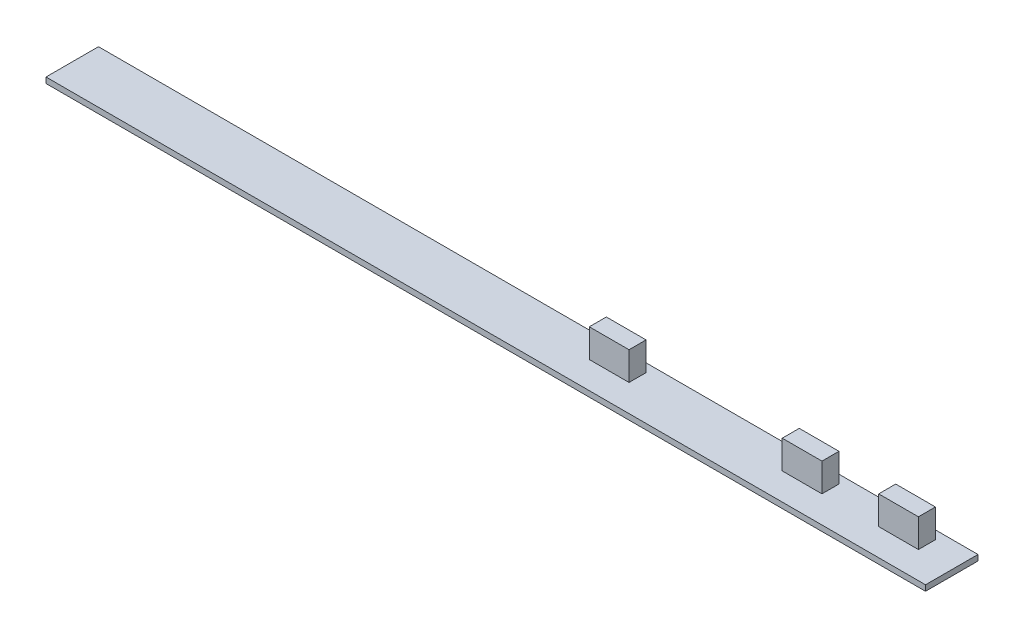
ISO-10303-21;
HEADER;
FILE_DESCRIPTION(('STEP AP214'),'2;1');
FILE_NAME('part.step','',(''),(''),'','','');
FILE_SCHEMA(('AUTOMOTIVE_DESIGN { 1 0 10303 214 1 1 1 1 }'));
ENDSEC;
DATA;
#1=APPLICATION_CONTEXT('core data for automotive mechanical design processes');
#2=APPLICATION_PROTOCOL_DEFINITION('international standard','automotive_design',2000,#1);
#3=PRODUCT_CONTEXT('',#1,'mechanical');
#4=PRODUCT('Part','Part','',(#3));
#5=PRODUCT_RELATED_PRODUCT_CATEGORY('part','',(#4));
#6=PRODUCT_DEFINITION_FORMATION('','',#4);
#7=PRODUCT_DEFINITION_CONTEXT('part definition',#1,'design');
#8=PRODUCT_DEFINITION('design','',#6,#7);
#9=PRODUCT_DEFINITION_SHAPE('','',#8);
#10=(LENGTH_UNIT() NAMED_UNIT(*) SI_UNIT(.MILLI.,.METRE.));
#11=(NAMED_UNIT(*) PLANE_ANGLE_UNIT() SI_UNIT($,.RADIAN.));
#12=(NAMED_UNIT(*) SI_UNIT($,.STERADIAN.) SOLID_ANGLE_UNIT());
#13=UNCERTAINTY_MEASURE_WITH_UNIT(LENGTH_MEASURE(1.E-05),#10,'distance_accuracy_value','');
#14=(GEOMETRIC_REPRESENTATION_CONTEXT(3) GLOBAL_UNCERTAINTY_ASSIGNED_CONTEXT((#13)) GLOBAL_UNIT_ASSIGNED_CONTEXT((#10,
#11,#12)) REPRESENTATION_CONTEXT('',''));
#15=CARTESIAN_POINT('',(0.,0.,0.));
#16=DIRECTION('',(0.,0.,1.));
#17=DIRECTION('',(1.,0.,0.));
#18=AXIS2_PLACEMENT_3D('',#15,#16,#17);
#19=CARTESIAN_POINT('',(635.59224857648,93.3157017452683,-15.231030609953));
#20=DIRECTION('',(0.,1.,0.));
#21=DIRECTION('',(0.,0.,1.));
#22=AXIS2_PLACEMENT_3D('',#19,#20,#21);
#23=PLANE('',#22);
#24=DIRECTION('',(0.,0.,-1.));
#25=VECTOR('',#24,1.);
#26=CARTESIAN_POINT('',(696.894917120642,93.3157017452683,55.9989117513526));
#27=LINE('',#26,#25);
#28=CARTESIAN_POINT('',(696.894917120642,93.3157017452683,52.9989117513526));
#29=VERTEX_POINT('',#28);
#30=CARTESIAN_POINT('',(696.894917120642,93.3157017452683,55.9989117513526));
#31=VERTEX_POINT('',#30);
#32=EDGE_CURVE('E143',#29,#31,#27,.F.);
#33=ORIENTED_EDGE('',*,*,#32,.F.);
#34=DIRECTION('',(-1.,0.,0.));
#35=VECTOR('',#34,1.);
#36=CARTESIAN_POINT('',(696.894917120642,93.3157017452683,52.9989117513526));
#37=LINE('',#36,#35);
#38=CARTESIAN_POINT('',(689.894917120642,93.3157017452683,52.9989117513526));
#39=VERTEX_POINT('',#38);
#40=EDGE_CURVE('E127',#39,#29,#37,.F.);
#41=ORIENTED_EDGE('',*,*,#40,.F.);
#42=DIRECTION('',(0.,0.,1.));
#43=VECTOR('',#42,1.);
#44=CARTESIAN_POINT('',(689.894917120642,93.3157017452683,52.9989117513526));
#45=LINE('',#44,#43);
#46=CARTESIAN_POINT('',(689.894917120642,93.3157017452683,55.9989117513526));
#47=VERTEX_POINT('',#46);
#48=EDGE_CURVE('E20',#47,#39,#45,.F.);
#49=ORIENTED_EDGE('',*,*,#48,.F.);
#50=DIRECTION('',(1.,0.,0.));
#51=VECTOR('',#50,1.);
#52=CARTESIAN_POINT('',(689.894917120642,93.3157017452683,55.9989117513526));
#53=LINE('',#52,#51);
#54=EDGE_CURVE('E150',#31,#47,#53,.F.);
#55=ORIENTED_EDGE('',*,*,#54,.F.);
#56=EDGE_LOOP('',(#33,#41,#49,#55));
#57=FACE_BOUND('',#56,.T.);
#58=ADVANCED_FACE('F17',(#57),#23,.T.);
#59=CARTESIAN_POINT('',(618.59224857648,93.3157017452683,-15.231030609953));
#60=DIRECTION('',(0.,1.,0.));
#61=DIRECTION('',(0.,0.,1.));
#62=AXIS2_PLACEMENT_3D('',#59,#60,#61);
#63=PLANE('',#62);
#64=DIRECTION('',(0.,0.,-1.));
#65=VECTOR('',#64,1.);
#66=CARTESIAN_POINT('',(679.894917120642,93.3157017452683,55.9989117513526));
#67=LINE('',#66,#65);
#68=CARTESIAN_POINT('',(679.894917120642,93.3157017452683,52.9989117513526));
#69=VERTEX_POINT('',#68);
#70=CARTESIAN_POINT('',(679.894917120642,93.3157017452683,55.9989117513526));
#71=VERTEX_POINT('',#70);
#72=EDGE_CURVE('E163',#69,#71,#67,.F.);
#73=ORIENTED_EDGE('',*,*,#72,.F.);
#74=DIRECTION('',(-1.,0.,0.));
#75=VECTOR('',#74,1.);
#76=CARTESIAN_POINT('',(679.894917120642,93.3157017452683,52.9989117513526));
#77=LINE('',#76,#75);
#78=CARTESIAN_POINT('',(672.894917120642,93.3157017452683,52.9989117513526));
#79=VERTEX_POINT('',#78);
#80=EDGE_CURVE('E158',#79,#69,#77,.F.);
#81=ORIENTED_EDGE('',*,*,#80,.F.);
#82=DIRECTION('',(0.,0.,1.));
#83=VECTOR('',#82,1.);
#84=CARTESIAN_POINT('',(672.894917120642,93.3157017452683,52.9989117513526));
#85=LINE('',#84,#83);
#86=CARTESIAN_POINT('',(672.894917120642,93.3157017452683,55.9989117513526));
#87=VERTEX_POINT('',#86);
#88=EDGE_CURVE('E156',#87,#79,#85,.F.);
#89=ORIENTED_EDGE('',*,*,#88,.F.);
#90=DIRECTION('',(1.,0.,0.));
#91=VECTOR('',#90,1.);
#92=CARTESIAN_POINT('',(672.894917120642,93.3157017452683,55.9989117513526));
#93=LINE('',#92,#91);
#94=EDGE_CURVE('E168',#71,#87,#93,.F.);
#95=ORIENTED_EDGE('',*,*,#94,.F.);
#96=EDGE_LOOP('',(#73,#81,#89,#95));
#97=FACE_BOUND('',#96,.T.);
#98=ADVANCED_FACE('F325',(#97),#63,.T.);
#99=CARTESIAN_POINT('',(584.59224857648,93.3157017452683,-15.231030609953));
#100=DIRECTION('',(0.,1.,0.));
#101=DIRECTION('',(0.,0.,1.));
#102=AXIS2_PLACEMENT_3D('',#99,#100,#101);
#103=PLANE('',#102);
#104=DIRECTION('',(0.,0.,-1.));
#105=VECTOR('',#104,1.);
#106=CARTESIAN_POINT('',(645.894917120642,93.3157017452683,55.9989117513526));
#107=LINE('',#106,#105);
#108=CARTESIAN_POINT('',(645.894917120642,93.3157017452683,52.9989117513526));
#109=VERTEX_POINT('',#108);
#110=CARTESIAN_POINT('',(645.894917120642,93.3157017452683,55.9989117513526));
#111=VERTEX_POINT('',#110);
#112=EDGE_CURVE('E182',#109,#111,#107,.F.);
#113=ORIENTED_EDGE('',*,*,#112,.F.);
#114=DIRECTION('',(-1.,0.,0.));
#115=VECTOR('',#114,1.);
#116=CARTESIAN_POINT('',(645.894917120642,93.3157017452683,52.9989117513526));
#117=LINE('',#116,#115);
#118=CARTESIAN_POINT('',(638.894917120642,93.3157017452683,52.9989117513526));
#119=VERTEX_POINT('',#118);
#120=EDGE_CURVE('E177',#119,#109,#117,.F.);
#121=ORIENTED_EDGE('',*,*,#120,.F.);
#122=DIRECTION('',(0.,0.,1.));
#123=VECTOR('',#122,1.);
#124=CARTESIAN_POINT('',(638.894917120642,93.3157017452683,52.9989117513526));
#125=LINE('',#124,#123);
#126=CARTESIAN_POINT('',(638.894917120642,93.3157017452683,55.9989117513526));
#127=VERTEX_POINT('',#126);
#128=EDGE_CURVE('E175',#127,#119,#125,.F.);
#129=ORIENTED_EDGE('',*,*,#128,.F.);
#130=DIRECTION('',(1.,0.,0.));
#131=VECTOR('',#130,1.);
#132=CARTESIAN_POINT('',(638.894917120642,93.3157017452683,55.9989117513526));
#133=LINE('',#132,#131);
#134=EDGE_CURVE('E187',#111,#127,#133,.F.);
#135=ORIENTED_EDGE('',*,*,#134,.F.);
#136=EDGE_LOOP('',(#113,#121,#129,#135));
#137=FACE_BOUND('',#136,.T.);
#138=ADVANCED_FACE('F323',(#137),#103,.T.);
#139=CARTESIAN_POINT('',(689.894917120642,93.3157017452683,52.9989117513526));
#140=DIRECTION('',(-1.,0.,0.));
#141=DIRECTION('',(0.,0.,1.));
#142=AXIS2_PLACEMENT_3D('',#139,#140,#141);
#143=PLANE('',#142);
#144=DIRECTION('',(0.,0.,1.));
#145=VECTOR('',#144,1.);
#146=CARTESIAN_POINT('',(689.894917120642,88.3157017452683,38.768969390047));
#147=LINE('',#146,#145);
#148=CARTESIAN_POINT('',(689.894917120642,88.3157017452683,55.9989117513526));
#149=VERTEX_POINT('',#148);
#150=CARTESIAN_POINT('',(689.894917120642,88.3157017452683,52.9989117513526));
#151=VERTEX_POINT('',#150);
#152=EDGE_CURVE('E194',#149,#151,#147,.F.);
#153=ORIENTED_EDGE('',*,*,#152,.F.);
#154=DIRECTION('',(0.,1.,0.));
#155=VECTOR('',#154,1.);
#156=CARTESIAN_POINT('',(689.894917120642,93.3157017452683,55.9989117513526));
#157=LINE('',#156,#155);
#158=EDGE_CURVE('E138',#47,#149,#157,.F.);
#159=ORIENTED_EDGE('',*,*,#158,.F.);
#160=ORIENTED_EDGE('',*,*,#48,.T.);
#161=DIRECTION('',(0.,1.,0.));
#162=VECTOR('',#161,1.);
#163=CARTESIAN_POINT('',(689.894917120642,93.3157017452683,52.9989117513526));
#164=LINE('',#163,#162);
#165=EDGE_CURVE('E136',#151,#39,#164,.T.);
#166=ORIENTED_EDGE('',*,*,#165,.F.);
#167=EDGE_LOOP('',(#153,#159,#160,#166));
#168=FACE_BOUND('',#167,.T.);
#169=ADVANCED_FACE('F135',(#168),#143,.T.);
#170=CARTESIAN_POINT('',(696.894917120642,93.3157017452683,52.9989117513526));
#171=DIRECTION('',(0.,0.,-1.));
#172=DIRECTION('',(-1.,0.,0.));
#173=AXIS2_PLACEMENT_3D('',#170,#171,#172);
#174=PLANE('',#173);
#175=DIRECTION('',(1.,0.,0.));
#176=VECTOR('',#175,1.);
#177=CARTESIAN_POINT('',(627.09224857648,88.3157017452683,52.9989117513526));
#178=LINE('',#177,#176);
#179=CARTESIAN_POINT('',(696.894917120642,88.3157017452683,52.9989117513526));
#180=VERTEX_POINT('',#179);
#181=EDGE_CURVE('E142',#151,#180,#178,.T.);
#182=ORIENTED_EDGE('',*,*,#181,.F.);
#183=ORIENTED_EDGE('',*,*,#165,.T.);
#184=ORIENTED_EDGE('',*,*,#40,.T.);
#185=DIRECTION('',(0.,1.,0.));
#186=VECTOR('',#185,1.);
#187=CARTESIAN_POINT('',(696.894917120642,93.3157017452683,52.9989117513526));
#188=LINE('',#187,#186);
#189=EDGE_CURVE('E148',#180,#29,#188,.T.);
#190=ORIENTED_EDGE('',*,*,#189,.F.);
#191=EDGE_LOOP('',(#182,#183,#184,#190));
#192=FACE_BOUND('',#191,.T.);
#193=ADVANCED_FACE('F141',(#192),#174,.T.);
#194=CARTESIAN_POINT('',(696.894917120642,93.3157017452683,55.9989117513526));
#195=DIRECTION('',(1.,0.,0.));
#196=DIRECTION('',(0.,0.,-1.));
#197=AXIS2_PLACEMENT_3D('',#194,#195,#196);
#198=PLANE('',#197);
#199=DIRECTION('',(0.,0.,1.));
#200=VECTOR('',#199,1.);
#201=CARTESIAN_POINT('',(696.894917120642,88.3157017452683,38.768969390047));
#202=LINE('',#201,#200);
#203=CARTESIAN_POINT('',(696.894917120642,88.3157017452683,55.9989117513526));
#204=VERTEX_POINT('',#203);
#205=EDGE_CURVE('E197',#180,#204,#202,.T.);
#206=ORIENTED_EDGE('',*,*,#205,.F.);
#207=ORIENTED_EDGE('',*,*,#189,.T.);
#208=ORIENTED_EDGE('',*,*,#32,.T.);
#209=DIRECTION('',(0.,1.,0.));
#210=VECTOR('',#209,1.);
#211=CARTESIAN_POINT('',(696.894917120642,93.3157017452683,55.9989117513526));
#212=LINE('',#211,#210);
#213=EDGE_CURVE('E153',#204,#31,#212,.T.);
#214=ORIENTED_EDGE('',*,*,#213,.F.);
#215=EDGE_LOOP('',(#206,#207,#208,#214));
#216=FACE_BOUND('',#215,.T.);
#217=ADVANCED_FACE('F314',(#216),#198,.T.);
#218=CARTESIAN_POINT('',(689.894917120642,93.3157017452683,55.9989117513526));
#219=DIRECTION('',(0.,0.,1.));
#220=DIRECTION('',(1.,0.,0.));
#221=AXIS2_PLACEMENT_3D('',#218,#219,#220);
#222=PLANE('',#221);
#223=DIRECTION('',(1.,0.,0.));
#224=VECTOR('',#223,1.);
#225=CARTESIAN_POINT('',(627.09224857648,88.3157017452683,55.9989117513526));
#226=LINE('',#225,#224);
#227=EDGE_CURVE('E199',#204,#149,#226,.F.);
#228=ORIENTED_EDGE('',*,*,#227,.F.);
#229=ORIENTED_EDGE('',*,*,#213,.T.);
#230=ORIENTED_EDGE('',*,*,#54,.T.);
#231=ORIENTED_EDGE('',*,*,#158,.T.);
#232=EDGE_LOOP('',(#228,#229,#230,#231));
#233=FACE_BOUND('',#232,.T.);
#234=ADVANCED_FACE('F310',(#233),#222,.T.);
#235=CARTESIAN_POINT('',(672.894917120642,93.3157017452683,52.9989117513526));
#236=DIRECTION('',(-1.,0.,0.));
#237=DIRECTION('',(0.,0.,1.));
#238=AXIS2_PLACEMENT_3D('',#235,#236,#237);
#239=PLANE('',#238);
#240=DIRECTION('',(0.,0.,1.));
#241=VECTOR('',#240,1.);
#242=CARTESIAN_POINT('',(672.894917120642,88.3157017452683,38.768969390047));
#243=LINE('',#242,#241);
#244=CARTESIAN_POINT('',(672.894917120642,88.3157017452683,55.9989117513526));
#245=VERTEX_POINT('',#244);
#246=CARTESIAN_POINT('',(672.894917120642,88.3157017452683,52.9989117513526));
#247=VERTEX_POINT('',#246);
#248=EDGE_CURVE('E202',#245,#247,#243,.F.);
#249=ORIENTED_EDGE('',*,*,#248,.F.);
#250=DIRECTION('',(0.,1.,0.));
#251=VECTOR('',#250,1.);
#252=CARTESIAN_POINT('',(672.894917120642,93.3157017452683,55.9989117513526));
#253=LINE('',#252,#251);
#254=EDGE_CURVE('E170',#87,#245,#253,.F.);
#255=ORIENTED_EDGE('',*,*,#254,.F.);
#256=ORIENTED_EDGE('',*,*,#88,.T.);
#257=DIRECTION('',(0.,1.,0.));
#258=VECTOR('',#257,1.);
#259=CARTESIAN_POINT('',(672.894917120642,93.3157017452683,52.9989117513526));
#260=LINE('',#259,#258);
#261=EDGE_CURVE('E160',#247,#79,#260,.T.);
#262=ORIENTED_EDGE('',*,*,#261,.F.);
#263=EDGE_LOOP('',(#249,#255,#256,#262));
#264=FACE_BOUND('',#263,.T.);
#265=ADVANCED_FACE('F306',(#264),#239,.T.);
#266=CARTESIAN_POINT('',(679.894917120642,93.3157017452683,52.9989117513526));
#267=DIRECTION('',(0.,0.,-1.));
#268=DIRECTION('',(-1.,0.,0.));
#269=AXIS2_PLACEMENT_3D('',#266,#267,#268);
#270=PLANE('',#269);
#271=DIRECTION('',(1.,0.,0.));
#272=VECTOR('',#271,1.);
#273=CARTESIAN_POINT('',(627.09224857648,88.3157017452683,52.9989117513526));
#274=LINE('',#273,#272);
#275=CARTESIAN_POINT('',(679.894917120642,88.3157017452683,52.9989117513526));
#276=VERTEX_POINT('',#275);
#277=EDGE_CURVE('E204',#247,#276,#274,.T.);
#278=ORIENTED_EDGE('',*,*,#277,.F.);
#279=ORIENTED_EDGE('',*,*,#261,.T.);
#280=ORIENTED_EDGE('',*,*,#80,.T.);
#281=DIRECTION('',(0.,1.,0.));
#282=VECTOR('',#281,1.);
#283=CARTESIAN_POINT('',(679.894917120642,93.3157017452683,52.9989117513526));
#284=LINE('',#283,#282);
#285=EDGE_CURVE('E165',#276,#69,#284,.T.);
#286=ORIENTED_EDGE('',*,*,#285,.F.);
#287=EDGE_LOOP('',(#278,#279,#280,#286));
#288=FACE_BOUND('',#287,.T.);
#289=ADVANCED_FACE('F302',(#288),#270,.T.);
#290=CARTESIAN_POINT('',(679.894917120642,93.3157017452683,55.9989117513526));
#291=DIRECTION('',(1.,0.,0.));
#292=DIRECTION('',(0.,0.,-1.));
#293=AXIS2_PLACEMENT_3D('',#290,#291,#292);
#294=PLANE('',#293);
#295=DIRECTION('',(0.,0.,1.));
#296=VECTOR('',#295,1.);
#297=CARTESIAN_POINT('',(679.894917120642,88.3157017452683,38.768969390047));
#298=LINE('',#297,#296);
#299=CARTESIAN_POINT('',(679.894917120642,88.3157017452683,55.9989117513526));
#300=VERTEX_POINT('',#299);
#301=EDGE_CURVE('E206',#276,#300,#298,.T.);
#302=ORIENTED_EDGE('',*,*,#301,.F.);
#303=ORIENTED_EDGE('',*,*,#285,.T.);
#304=ORIENTED_EDGE('',*,*,#72,.T.);
#305=DIRECTION('',(0.,1.,0.));
#306=VECTOR('',#305,1.);
#307=CARTESIAN_POINT('',(679.894917120642,93.3157017452683,55.9989117513526));
#308=LINE('',#307,#306);
#309=EDGE_CURVE('E172',#300,#71,#308,.T.);
#310=ORIENTED_EDGE('',*,*,#309,.F.);
#311=EDGE_LOOP('',(#302,#303,#304,#310));
#312=FACE_BOUND('',#311,.T.);
#313=ADVANCED_FACE('F298',(#312),#294,.T.);
#314=CARTESIAN_POINT('',(672.894917120642,93.3157017452683,55.9989117513526));
#315=DIRECTION('',(0.,0.,1.));
#316=DIRECTION('',(1.,0.,0.));
#317=AXIS2_PLACEMENT_3D('',#314,#315,#316);
#318=PLANE('',#317);
#319=DIRECTION('',(1.,0.,0.));
#320=VECTOR('',#319,1.);
#321=CARTESIAN_POINT('',(627.09224857648,88.3157017452683,55.9989117513526));
#322=LINE('',#321,#320);
#323=EDGE_CURVE('E208',#300,#245,#322,.F.);
#324=ORIENTED_EDGE('',*,*,#323,.F.);
#325=ORIENTED_EDGE('',*,*,#309,.T.);
#326=ORIENTED_EDGE('',*,*,#94,.T.);
#327=ORIENTED_EDGE('',*,*,#254,.T.);
#328=EDGE_LOOP('',(#324,#325,#326,#327));
#329=FACE_BOUND('',#328,.T.);
#330=ADVANCED_FACE('F294',(#329),#318,.T.);
#331=CARTESIAN_POINT('',(638.894917120642,93.3157017452683,52.9989117513526));
#332=DIRECTION('',(-1.,0.,0.));
#333=DIRECTION('',(0.,0.,1.));
#334=AXIS2_PLACEMENT_3D('',#331,#332,#333);
#335=PLANE('',#334);
#336=DIRECTION('',(0.,0.,1.));
#337=VECTOR('',#336,1.);
#338=CARTESIAN_POINT('',(638.894917120642,88.3157017452683,38.768969390047));
#339=LINE('',#338,#337);
#340=CARTESIAN_POINT('',(638.894917120642,88.3157017452683,55.9989117513526));
#341=VERTEX_POINT('',#340);
#342=CARTESIAN_POINT('',(638.894917120642,88.3157017452683,52.9989117513526));
#343=VERTEX_POINT('',#342);
#344=EDGE_CURVE('E211',#341,#343,#339,.F.);
#345=ORIENTED_EDGE('',*,*,#344,.F.);
#346=DIRECTION('',(0.,1.,0.));
#347=VECTOR('',#346,1.);
#348=CARTESIAN_POINT('',(638.894917120642,93.3157017452683,55.9989117513526));
#349=LINE('',#348,#347);
#350=EDGE_CURVE('E189',#127,#341,#349,.F.);
#351=ORIENTED_EDGE('',*,*,#350,.F.);
#352=ORIENTED_EDGE('',*,*,#128,.T.);
#353=DIRECTION('',(0.,1.,0.));
#354=VECTOR('',#353,1.);
#355=CARTESIAN_POINT('',(638.894917120642,93.3157017452683,52.9989117513526));
#356=LINE('',#355,#354);
#357=EDGE_CURVE('E179',#343,#119,#356,.T.);
#358=ORIENTED_EDGE('',*,*,#357,.F.);
#359=EDGE_LOOP('',(#345,#351,#352,#358));
#360=FACE_BOUND('',#359,.T.);
#361=ADVANCED_FACE('F290',(#360),#335,.T.);
#362=CARTESIAN_POINT('',(645.894917120642,93.3157017452683,52.9989117513526));
#363=DIRECTION('',(0.,0.,-1.));
#364=DIRECTION('',(-1.,0.,0.));
#365=AXIS2_PLACEMENT_3D('',#362,#363,#364);
#366=PLANE('',#365);
#367=DIRECTION('',(1.,0.,0.));
#368=VECTOR('',#367,1.);
#369=CARTESIAN_POINT('',(627.09224857648,88.3157017452683,52.9989117513526));
#370=LINE('',#369,#368);
#371=CARTESIAN_POINT('',(645.894917120642,88.3157017452683,52.9989117513526));
#372=VERTEX_POINT('',#371);
#373=EDGE_CURVE('E213',#343,#372,#370,.T.);
#374=ORIENTED_EDGE('',*,*,#373,.F.);
#375=ORIENTED_EDGE('',*,*,#357,.T.);
#376=ORIENTED_EDGE('',*,*,#120,.T.);
#377=DIRECTION('',(0.,1.,0.));
#378=VECTOR('',#377,1.);
#379=CARTESIAN_POINT('',(645.894917120642,93.3157017452683,52.9989117513526));
#380=LINE('',#379,#378);
#381=EDGE_CURVE('E184',#372,#109,#380,.T.);
#382=ORIENTED_EDGE('',*,*,#381,.F.);
#383=EDGE_LOOP('',(#374,#375,#376,#382));
#384=FACE_BOUND('',#383,.T.);
#385=ADVANCED_FACE('F286',(#384),#366,.T.);
#386=CARTESIAN_POINT('',(645.894917120642,93.3157017452683,55.9989117513526));
#387=DIRECTION('',(1.,0.,0.));
#388=DIRECTION('',(0.,0.,-1.));
#389=AXIS2_PLACEMENT_3D('',#386,#387,#388);
#390=PLANE('',#389);
#391=DIRECTION('',(0.,0.,1.));
#392=VECTOR('',#391,1.);
#393=CARTESIAN_POINT('',(645.894917120642,88.3157017452683,38.768969390047));
#394=LINE('',#393,#392);
#395=CARTESIAN_POINT('',(645.894917120642,88.3157017452683,55.9989117513526));
#396=VERTEX_POINT('',#395);
#397=EDGE_CURVE('E215',#372,#396,#394,.T.);
#398=ORIENTED_EDGE('',*,*,#397,.F.);
#399=ORIENTED_EDGE('',*,*,#381,.T.);
#400=ORIENTED_EDGE('',*,*,#112,.T.);
#401=DIRECTION('',(0.,1.,0.));
#402=VECTOR('',#401,1.);
#403=CARTESIAN_POINT('',(645.894917120642,93.3157017452683,55.9989117513526));
#404=LINE('',#403,#402);
#405=EDGE_CURVE('E191',#396,#111,#404,.T.);
#406=ORIENTED_EDGE('',*,*,#405,.F.);
#407=EDGE_LOOP('',(#398,#399,#400,#406));
#408=FACE_BOUND('',#407,.T.);
#409=ADVANCED_FACE('F282',(#408),#390,.T.);
#410=CARTESIAN_POINT('',(638.894917120642,93.3157017452683,55.9989117513526));
#411=DIRECTION('',(0.,0.,1.));
#412=DIRECTION('',(1.,0.,0.));
#413=AXIS2_PLACEMENT_3D('',#410,#411,#412);
#414=PLANE('',#413);
#415=DIRECTION('',(1.,0.,0.));
#416=VECTOR('',#415,1.);
#417=CARTESIAN_POINT('',(627.09224857648,88.3157017452683,55.9989117513526));
#418=LINE('',#417,#416);
#419=EDGE_CURVE('E217',#396,#341,#418,.F.);
#420=ORIENTED_EDGE('',*,*,#419,.F.);
#421=ORIENTED_EDGE('',*,*,#405,.T.);
#422=ORIENTED_EDGE('',*,*,#134,.T.);
#423=ORIENTED_EDGE('',*,*,#350,.T.);
#424=EDGE_LOOP('',(#420,#421,#422,#423));
#425=FACE_BOUND('',#424,.T.);
#426=ADVANCED_FACE('F278',(#425),#414,.T.);
#427=CARTESIAN_POINT('',(627.09224857648,88.3157017452683,38.768969390047));
#428=DIRECTION('',(0.,1.,0.));
#429=DIRECTION('',(0.,0.,1.));
#430=AXIS2_PLACEMENT_3D('',#427,#428,#429);
#431=PLANE('',#430);
#432=ORIENTED_EDGE('',*,*,#397,.T.);
#433=ORIENTED_EDGE('',*,*,#419,.T.);
#434=ORIENTED_EDGE('',*,*,#344,.T.);
#435=ORIENTED_EDGE('',*,*,#373,.T.);
#436=EDGE_LOOP('',(#432,#433,#434,#435));
#437=FACE_BOUND('',#436,.T.);
#438=ORIENTED_EDGE('',*,*,#301,.T.);
#439=ORIENTED_EDGE('',*,*,#323,.T.);
#440=ORIENTED_EDGE('',*,*,#248,.T.);
#441=ORIENTED_EDGE('',*,*,#277,.T.);
#442=EDGE_LOOP('',(#438,#439,#440,#441));
#443=FACE_BOUND('',#442,.T.);
#444=ORIENTED_EDGE('',*,*,#205,.T.);
#445=ORIENTED_EDGE('',*,*,#227,.T.);
#446=ORIENTED_EDGE('',*,*,#152,.T.);
#447=ORIENTED_EDGE('',*,*,#181,.T.);
#448=EDGE_LOOP('',(#444,#445,#446,#447));
#449=FACE_BOUND('',#448,.T.);
#450=DIRECTION('',(-1.,0.,0.));
#451=VECTOR('',#450,1.);
#452=CARTESIAN_POINT('',(547.894917120642,88.3157017452683,51.4989117513526));
#453=LINE('',#452,#451);
#454=CARTESIAN_POINT('',(547.894917120642,88.3157017452683,51.4989117513526));
#455=VERTEX_POINT('',#454);
#456=CARTESIAN_POINT('',(702.894917120642,88.3157017452683,51.4989117513526));
#457=VERTEX_POINT('',#456);
#458=EDGE_CURVE('E235',#455,#457,#453,.F.);
#459=ORIENTED_EDGE('',*,*,#458,.F.);
#460=DIRECTION('',(0.,0.,1.));
#461=VECTOR('',#460,1.);
#462=CARTESIAN_POINT('',(547.894917120642,88.3157017452683,111.498911751353));
#463=LINE('',#462,#461);
#464=CARTESIAN_POINT('',(547.894917120642,88.3157017452683,60.7489117513526));
#465=VERTEX_POINT('',#464);
#466=EDGE_CURVE('E220',#465,#455,#463,.F.);
#467=ORIENTED_EDGE('',*,*,#466,.F.);
#468=DIRECTION('',(-1.,0.,0.));
#469=VECTOR('',#468,1.);
#470=CARTESIAN_POINT('',(234.762444,88.3157017452683,60.7489117513526));
#471=LINE('',#470,#469);
#472=CARTESIAN_POINT('',(702.894917120642,88.3157017452683,60.7489117513526));
#473=VERTEX_POINT('',#472);
#474=EDGE_CURVE('E225',#465,#473,#471,.F.);
#475=ORIENTED_EDGE('',*,*,#474,.T.);
#476=DIRECTION('',(0.,0.,-1.));
#477=VECTOR('',#476,1.);
#478=CARTESIAN_POINT('',(702.894917120642,88.3157017452683,51.4989117513526));
#479=LINE('',#478,#477);
#480=EDGE_CURVE('E228',#457,#473,#479,.F.);
#481=ORIENTED_EDGE('',*,*,#480,.F.);
#482=EDGE_LOOP('',(#459,#467,#475,#481));
#483=FACE_BOUND('',#482,.T.);
#484=ADVANCED_FACE('F275',(#437,#443,#449,#483),#431,.T.);
#485=CARTESIAN_POINT('',(547.894917120642,87.3157017452683,111.498911751353));
#486=DIRECTION('',(-1.,0.,0.));
#487=DIRECTION('',(0.,0.,1.));
#488=AXIS2_PLACEMENT_3D('',#485,#486,#487);
#489=PLANE('',#488);
#490=DIRECTION('',(0.,1.,0.));
#491=VECTOR('',#490,1.);
#492=CARTESIAN_POINT('',(547.894917120642,87.3157017452683,51.4989117513526));
#493=LINE('',#492,#491);
#494=CARTESIAN_POINT('',(547.894917120642,87.3157017452683,51.4989117513526));
#495=VERTEX_POINT('',#494);
#496=EDGE_CURVE('E232',#495,#455,#493,.T.);
#497=ORIENTED_EDGE('',*,*,#496,.F.);
#498=DIRECTION('',(0.,0.,1.));
#499=VECTOR('',#498,1.);
#500=CARTESIAN_POINT('',(547.894917120642,87.3157017452683,38.768969390047));
#501=LINE('',#500,#499);
#502=CARTESIAN_POINT('',(547.894917120642,87.3157017452683,60.7489117513526));
#503=VERTEX_POINT('',#502);
#504=EDGE_CURVE('E238',#495,#503,#501,.T.);
#505=ORIENTED_EDGE('',*,*,#504,.T.);
#506=DIRECTION('',(0.,1.,0.));
#507=VECTOR('',#506,1.);
#508=CARTESIAN_POINT('',(547.894917120642,86.7156777452683,60.7489117513526));
#509=LINE('',#508,#507);
#510=EDGE_CURVE('E222',#503,#465,#509,.T.);
#511=ORIENTED_EDGE('',*,*,#510,.T.);
#512=ORIENTED_EDGE('',*,*,#466,.T.);
#513=EDGE_LOOP('',(#497,#505,#511,#512));
#514=FACE_BOUND('',#513,.T.);
#515=ADVANCED_FACE('F257',(#514),#489,.T.);
#516=CARTESIAN_POINT('',(234.762444,86.7156777452683,60.7489117513526));
#517=DIRECTION('',(0.,0.,-1.));
#518=DIRECTION('',(-1.,0.,0.));
#519=AXIS2_PLACEMENT_3D('',#516,#517,#518);
#520=PLANE('',#519);
#521=ORIENTED_EDGE('',*,*,#474,.F.);
#522=ORIENTED_EDGE('',*,*,#510,.F.);
#523=DIRECTION('',(1.,0.,0.));
#524=VECTOR('',#523,1.);
#525=CARTESIAN_POINT('',(627.09224857648,87.3157017452683,60.7489117513526));
#526=LINE('',#525,#524);
#527=CARTESIAN_POINT('',(702.894917120642,87.3157017452683,60.7489117513526));
#528=VERTEX_POINT('',#527);
#529=EDGE_CURVE('E241',#503,#528,#526,.T.);
#530=ORIENTED_EDGE('',*,*,#529,.T.);
#531=DIRECTION('',(0.,1.,0.));
#532=VECTOR('',#531,1.);
#533=CARTESIAN_POINT('',(702.894917120642,87.3157017452683,60.7489117513526));
#534=LINE('',#533,#532);
#535=EDGE_CURVE('E230',#473,#528,#534,.F.);
#536=ORIENTED_EDGE('',*,*,#535,.F.);
#537=EDGE_LOOP('',(#521,#522,#530,#536));
#538=FACE_BOUND('',#537,.T.);
#539=ADVANCED_FACE('F254',(#538),#520,.F.);
#540=CARTESIAN_POINT('',(702.894917120642,87.3157017452683,51.4989117513526));
#541=DIRECTION('',(1.,0.,0.));
#542=DIRECTION('',(0.,0.,-1.));
#543=AXIS2_PLACEMENT_3D('',#540,#541,#542);
#544=PLANE('',#543);
#545=ORIENTED_EDGE('',*,*,#480,.T.);
#546=ORIENTED_EDGE('',*,*,#535,.T.);
#547=DIRECTION('',(0.,0.,1.));
#548=VECTOR('',#547,1.);
#549=CARTESIAN_POINT('',(702.894917120642,87.3157017452683,38.768969390047));
#550=LINE('',#549,#548);
#551=CARTESIAN_POINT('',(702.894917120642,87.3157017452683,51.4989117513526));
#552=VERTEX_POINT('',#551);
#553=EDGE_CURVE('E26',#528,#552,#550,.F.);
#554=ORIENTED_EDGE('',*,*,#553,.T.);
#555=DIRECTION('',(0.,1.,0.));
#556=VECTOR('',#555,1.);
#557=CARTESIAN_POINT('',(702.894917120642,87.3157017452683,51.4989117513526));
#558=LINE('',#557,#556);
#559=EDGE_CURVE('E34',#457,#552,#558,.F.);
#560=ORIENTED_EDGE('',*,*,#559,.F.);
#561=EDGE_LOOP('',(#545,#546,#554,#560));
#562=FACE_BOUND('',#561,.T.);
#563=ADVANCED_FACE('F247',(#562),#544,.T.);
#564=CARTESIAN_POINT('',(547.894917120642,87.3157017452683,51.4989117513526));
#565=DIRECTION('',(0.,0.,-1.));
#566=DIRECTION('',(-1.,0.,0.));
#567=AXIS2_PLACEMENT_3D('',#564,#565,#566);
#568=PLANE('',#567);
#569=ORIENTED_EDGE('',*,*,#458,.T.);
#570=ORIENTED_EDGE('',*,*,#559,.T.);
#571=DIRECTION('',(1.,0.,0.));
#572=VECTOR('',#571,1.);
#573=CARTESIAN_POINT('',(627.09224857648,87.3157017452683,51.4989117513526));
#574=LINE('',#573,#572);
#575=EDGE_CURVE('E11',#552,#495,#574,.F.);
#576=ORIENTED_EDGE('',*,*,#575,.T.);
#577=ORIENTED_EDGE('',*,*,#496,.T.);
#578=EDGE_LOOP('',(#569,#570,#576,#577));
#579=FACE_BOUND('',#578,.T.);
#580=ADVANCED_FACE('F259',(#579),#568,.T.);
#581=CARTESIAN_POINT('',(627.09224857648,87.3157017452683,38.768969390047));
#582=DIRECTION('',(0.,1.,0.));
#583=DIRECTION('',(0.,0.,1.));
#584=AXIS2_PLACEMENT_3D('',#581,#582,#583);
#585=PLANE('',#584);
#586=ORIENTED_EDGE('',*,*,#553,.F.);
#587=ORIENTED_EDGE('',*,*,#529,.F.);
#588=ORIENTED_EDGE('',*,*,#504,.F.);
#589=ORIENTED_EDGE('',*,*,#575,.F.);
#590=EDGE_LOOP('',(#586,#587,#588,#589));
#591=FACE_BOUND('',#590,.T.);
#592=ADVANCED_FACE('F251',(#591),#585,.F.);
#593=CLOSED_SHELL('',(#58,#98,#138,#169,#193,#217,#234,#265,#289,#313,#330,#361,#385,#409,#426,
#484,#515,#539,#563,#580,#592));
#594=MANIFOLD_SOLID_BREP('B1',#593);
#595=ADVANCED_BREP_SHAPE_REPRESENTATION('',(#18,#594),#14);
#596=SHAPE_DEFINITION_REPRESENTATION(#9,#595);
ENDSEC;
END-ISO-10303-21;
